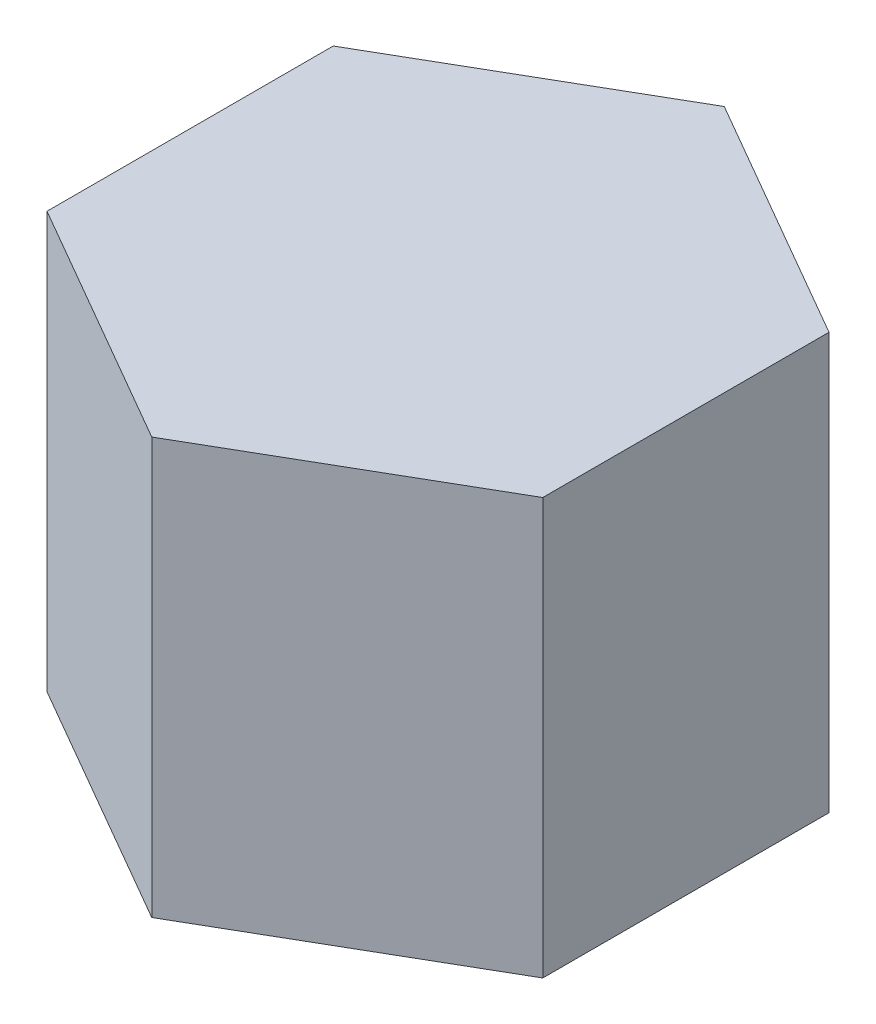
ISO-10303-21;
HEADER;
FILE_DESCRIPTION(('STEP AP214'),'2;1');
FILE_NAME('part.step','',(''),(''),'','','');
FILE_SCHEMA(('AUTOMOTIVE_DESIGN { 1 0 10303 214 1 1 1 1 }'));
ENDSEC;
DATA;
#1=APPLICATION_CONTEXT('core data for automotive mechanical design processes');
#2=APPLICATION_PROTOCOL_DEFINITION('international standard','automotive_design',2000,#1);
#3=PRODUCT_CONTEXT('',#1,'mechanical');
#4=PRODUCT('Part','Part','',(#3));
#5=PRODUCT_RELATED_PRODUCT_CATEGORY('part','',(#4));
#6=PRODUCT_DEFINITION_FORMATION('','',#4);
#7=PRODUCT_DEFINITION_CONTEXT('part definition',#1,'design');
#8=PRODUCT_DEFINITION('design','',#6,#7);
#9=PRODUCT_DEFINITION_SHAPE('','',#8);
#10=(LENGTH_UNIT() NAMED_UNIT(*) SI_UNIT(.MILLI.,.METRE.));
#11=(NAMED_UNIT(*) PLANE_ANGLE_UNIT() SI_UNIT($,.RADIAN.));
#12=(NAMED_UNIT(*) SI_UNIT($,.STERADIAN.) SOLID_ANGLE_UNIT());
#13=UNCERTAINTY_MEASURE_WITH_UNIT(LENGTH_MEASURE(1.E-05),#10,'distance_accuracy_value','');
#14=(GEOMETRIC_REPRESENTATION_CONTEXT(3) GLOBAL_UNCERTAINTY_ASSIGNED_CONTEXT((#13)) GLOBAL_UNIT_ASSIGNED_CONTEXT((#10,
#11,#12)) REPRESENTATION_CONTEXT('',''));
#15=CARTESIAN_POINT('',(0.,0.,0.));
#16=DIRECTION('',(0.,0.,1.));
#17=DIRECTION('',(1.,0.,0.));
#18=AXIS2_PLACEMENT_3D('',#15,#16,#17);
#19=CARTESIAN_POINT('',(204.839551417382,-147.556598747966,294.280047431848));
#20=DIRECTION('',(-0.500000000000096,0.,-0.866025403784383));
#21=DIRECTION('',(-0.866025403784383,0.,0.500000000000096));
#22=AXIS2_PLACEMENT_3D('',#19,#20,#21);
#23=PLANE('',#22);
#24=CARTESIAN_POINT('',(205.142660308706,-147.047793579175,294.105047431848));
#25=DIRECTION('',(-0.866025403784383,0.,0.500000000000096));
#26=VECTOR('',#25,1.);
#27=LINE('',#24,#26);
#28=CARTESIAN_POINT('',(205.142660308706,-147.047793579175,294.105047431848));
#29=VERTEX_POINT('',#28);
#30=CARTESIAN_POINT('',(204.839551417382,-147.047793579175,294.280047431848));
#31=VERTEX_POINT('',#30);
#32=EDGE_CURVE('E170',#29,#31,#27,.T.);
#33=ORIENTED_EDGE('',*,*,#32,.T.);
#34=CARTESIAN_POINT('',(204.839551417382,-147.556598747966,294.280047431848));
#35=DIRECTION('',(0.,1.,0.));
#36=VECTOR('',#35,1.);
#37=LINE('',#34,#36);
#38=CARTESIAN_POINT('',(204.839551417382,-147.556598747966,294.280047431848));
#39=VERTEX_POINT('',#38);
#40=EDGE_CURVE('E35',#39,#31,#37,.T.);
#41=ORIENTED_EDGE('',*,*,#40,.F.);
#42=CARTESIAN_POINT('',(205.142660308706,-147.556598747966,294.105047431848));
#43=DIRECTION('',(-0.866025403784383,0.,0.500000000000096));
#44=VECTOR('',#43,1.);
#45=LINE('',#42,#44);
#46=CARTESIAN_POINT('',(205.142660308706,-147.556598747966,294.105047431848));
#47=VERTEX_POINT('',#46);
#48=EDGE_CURVE('E159',#47,#39,#45,.T.);
#49=ORIENTED_EDGE('',*,*,#48,.F.);
#50=CARTESIAN_POINT('',(205.142660308706,-147.556598747966,294.105047431848));
#51=DIRECTION('',(0.,1.,0.));
#52=VECTOR('',#51,1.);
#53=LINE('',#50,#52);
#54=EDGE_CURVE('E10',#47,#29,#53,.T.);
#55=ORIENTED_EDGE('',*,*,#54,.T.);
#56=EDGE_LOOP('',(#33,#41,#49,#55));
#57=FACE_BOUND('',#56,.T.);
#58=ADVANCED_FACE('F16',(#57),#23,.F.);
#59=CARTESIAN_POINT('',(205.142660308706,-147.556598747966,291.594471220494));
#60=DIRECTION('',(-1.,0.,0.));
#61=DIRECTION('',(0.,-1.,0.));
#62=AXIS2_PLACEMENT_3D('',#59,#60,#61);
#63=PLANE('',#62);
#64=CARTESIAN_POINT('',(205.142660308706,-147.047793579175,293.755047431848));
#65=DIRECTION('',(0.,0.,1.));
#66=VECTOR('',#65,1.);
#67=LINE('',#64,#66);
#68=CARTESIAN_POINT('',(205.142660308706,-147.047793579175,293.755047431848));
#69=VERTEX_POINT('',#68);
#70=EDGE_CURVE('E167',#69,#29,#67,.T.);
#71=ORIENTED_EDGE('',*,*,#70,.T.);
#72=ORIENTED_EDGE('',*,*,#54,.F.);
#73=CARTESIAN_POINT('',(205.142660308706,-147.556598747966,293.755047431848));
#74=DIRECTION('',(0.,0.,1.));
#75=VECTOR('',#74,1.);
#76=LINE('',#73,#75);
#77=CARTESIAN_POINT('',(205.142660308706,-147.556598747966,293.755047431848));
#78=VERTEX_POINT('',#77);
#79=EDGE_CURVE('E156',#78,#47,#76,.T.);
#80=ORIENTED_EDGE('',*,*,#79,.F.);
#81=CARTESIAN_POINT('',(205.142660308706,-147.556598747966,293.755047431848));
#82=DIRECTION('',(0.,1.,0.));
#83=VECTOR('',#82,1.);
#84=LINE('',#81,#83);
#85=EDGE_CURVE('E27',#78,#69,#84,.T.);
#86=ORIENTED_EDGE('',*,*,#85,.T.);
#87=EDGE_LOOP('',(#71,#72,#80,#86));
#88=FACE_BOUND('',#87,.T.);
#89=ADVANCED_FACE('F189',(#88),#63,.F.);
#90=CARTESIAN_POINT('',(205.142660308706,-147.556598747966,293.755047431848));
#91=DIRECTION('',(-0.500000000000096,0.,0.866025403784383));
#92=DIRECTION('',(0.866025403784383,0.,0.500000000000096));
#93=AXIS2_PLACEMENT_3D('',#90,#91,#92);
#94=PLANE('',#93);
#95=CARTESIAN_POINT('',(204.839551417382,-147.047793579175,293.580047431848));
#96=DIRECTION('',(0.866025403784383,0.,0.500000000000096));
#97=VECTOR('',#96,1.);
#98=LINE('',#95,#97);
#99=CARTESIAN_POINT('',(204.839551417382,-147.047793579175,293.580047431848));
#100=VERTEX_POINT('',#99);
#101=EDGE_CURVE('E163',#100,#69,#98,.T.);
#102=ORIENTED_EDGE('',*,*,#101,.T.);
#103=ORIENTED_EDGE('',*,*,#85,.F.);
#104=CARTESIAN_POINT('',(204.839551417382,-147.556598747966,293.580047431848));
#105=DIRECTION('',(0.866025403784383,0.,0.500000000000096));
#106=VECTOR('',#105,1.);
#107=LINE('',#104,#106);
#108=CARTESIAN_POINT('',(204.839551417382,-147.556598747966,293.580047431848));
#109=VERTEX_POINT('',#108);
#110=EDGE_CURVE('E106',#109,#78,#107,.T.);
#111=ORIENTED_EDGE('',*,*,#110,.F.);
#112=CARTESIAN_POINT('',(204.839551417382,-147.556598747966,293.580047431848));
#113=DIRECTION('',(0.,1.,0.));
#114=VECTOR('',#113,1.);
#115=LINE('',#112,#114);
#116=EDGE_CURVE('E94',#109,#100,#115,.T.);
#117=ORIENTED_EDGE('',*,*,#116,.T.);
#118=EDGE_LOOP('',(#102,#103,#111,#117));
#119=FACE_BOUND('',#118,.T.);
#120=ADVANCED_FACE('F198',(#119),#94,.F.);
#121=CARTESIAN_POINT('',(204.839551417382,-147.556598747966,293.580047431848));
#122=DIRECTION('',(0.500000000000096,0.,0.866025403784383));
#123=DIRECTION('',(0.866025403784383,0.,-0.500000000000096));
#124=AXIS2_PLACEMENT_3D('',#121,#122,#123);
#125=PLANE('',#124);
#126=CARTESIAN_POINT('',(204.536442526057,-147.047793579175,293.755047431848));
#127=DIRECTION('',(0.866025403784383,0.,-0.500000000000096));
#128=VECTOR('',#127,1.);
#129=LINE('',#126,#128);
#130=CARTESIAN_POINT('',(204.536442526057,-147.047793579175,293.755047431848));
#131=VERTEX_POINT('',#130);
#132=EDGE_CURVE('E162',#131,#100,#129,.T.);
#133=ORIENTED_EDGE('',*,*,#132,.T.);
#134=ORIENTED_EDGE('',*,*,#116,.F.);
#135=CARTESIAN_POINT('',(204.536442526057,-147.556598747966,293.755047431848));
#136=DIRECTION('',(0.866025403784383,0.,-0.500000000000096));
#137=VECTOR('',#136,1.);
#138=LINE('',#135,#137);
#139=CARTESIAN_POINT('',(204.536442526057,-147.556598747966,293.755047431848));
#140=VERTEX_POINT('',#139);
#141=EDGE_CURVE('E98',#140,#109,#138,.T.);
#142=ORIENTED_EDGE('',*,*,#141,.F.);
#143=CARTESIAN_POINT('',(204.536442526057,-147.556598747966,293.755047431848));
#144=DIRECTION('',(0.,1.,0.));
#145=VECTOR('',#144,1.);
#146=LINE('',#143,#145);
#147=EDGE_CURVE('E79',#140,#131,#146,.T.);
#148=ORIENTED_EDGE('',*,*,#147,.T.);
#149=EDGE_LOOP('',(#133,#134,#142,#148));
#150=FACE_BOUND('',#149,.T.);
#151=ADVANCED_FACE('F100',(#150),#125,.F.);
#152=CARTESIAN_POINT('',(204.536442526057,-147.556598747966,291.594471220494));
#153=DIRECTION('',(1.,0.,0.));
#154=DIRECTION('',(0.,1.,0.));
#155=AXIS2_PLACEMENT_3D('',#152,#153,#154);
#156=PLANE('',#155);
#157=CARTESIAN_POINT('',(204.536442526057,-147.047793579175,294.105047431848));
#158=DIRECTION('',(0.,0.,-1.));
#159=VECTOR('',#158,1.);
#160=LINE('',#157,#159);
#161=CARTESIAN_POINT('',(204.536442526057,-147.047793579175,294.105047431848));
#162=VERTEX_POINT('',#161);
#163=EDGE_CURVE('E88',#162,#131,#160,.T.);
#164=ORIENTED_EDGE('',*,*,#163,.T.);
#165=ORIENTED_EDGE('',*,*,#147,.F.);
#166=CARTESIAN_POINT('',(204.536442526057,-147.556598747966,294.105047431848));
#167=DIRECTION('',(0.,0.,-1.));
#168=VECTOR('',#167,1.);
#169=LINE('',#166,#168);
#170=CARTESIAN_POINT('',(204.536442526057,-147.556598747966,294.105047431848));
#171=VERTEX_POINT('',#170);
#172=EDGE_CURVE('E84',#171,#140,#169,.T.);
#173=ORIENTED_EDGE('',*,*,#172,.F.);
#174=CARTESIAN_POINT('',(204.536442526057,-147.556598747966,294.105047431848));
#175=DIRECTION('',(0.,1.,0.));
#176=VECTOR('',#175,1.);
#177=LINE('',#174,#176);
#178=EDGE_CURVE('E58',#171,#162,#177,.T.);
#179=ORIENTED_EDGE('',*,*,#178,.T.);
#180=EDGE_LOOP('',(#164,#165,#173,#179));
#181=FACE_BOUND('',#180,.T.);
#182=ADVANCED_FACE('F82',(#181),#156,.F.);
#183=CARTESIAN_POINT('',(204.536442526057,-147.556598747966,294.105047431848));
#184=DIRECTION('',(0.500000000000062,0.,-0.866025403784403));
#185=DIRECTION('',(-0.866025403784403,0.,-0.500000000000062));
#186=AXIS2_PLACEMENT_3D('',#183,#184,#185);
#187=PLANE('',#186);
#188=CARTESIAN_POINT('',(204.839551417382,-147.047793579175,294.280047431848));
#189=DIRECTION('',(-0.866025403784403,0.,-0.500000000000062));
#190=VECTOR('',#189,1.);
#191=LINE('',#188,#190);
#192=EDGE_CURVE('E160',#31,#162,#191,.T.);
#193=ORIENTED_EDGE('',*,*,#192,.T.);
#194=ORIENTED_EDGE('',*,*,#178,.F.);
#195=CARTESIAN_POINT('',(204.839551417382,-147.556598747966,294.280047431848));
#196=DIRECTION('',(-0.866025403784403,0.,-0.500000000000062));
#197=VECTOR('',#196,1.);
#198=LINE('',#195,#197);
#199=EDGE_CURVE('E112',#39,#171,#198,.T.);
#200=ORIENTED_EDGE('',*,*,#199,.F.);
#201=ORIENTED_EDGE('',*,*,#40,.T.);
#202=EDGE_LOOP('',(#193,#194,#200,#201));
#203=FACE_BOUND('',#202,.T.);
#204=ADVANCED_FACE('F131',(#203),#187,.F.);
#205=CARTESIAN_POINT('',(206.491105863044,-147.556598747966,291.594471220494));
#206=DIRECTION('',(0.,1.,0.));
#207=DIRECTION('',(-1.,0.,0.));
#208=AXIS2_PLACEMENT_3D('',#205,#206,#207);
#209=PLANE('',#208);
#210=ORIENTED_EDGE('',*,*,#48,.T.);
#211=ORIENTED_EDGE('',*,*,#199,.T.);
#212=ORIENTED_EDGE('',*,*,#172,.T.);
#213=ORIENTED_EDGE('',*,*,#141,.T.);
#214=ORIENTED_EDGE('',*,*,#110,.T.);
#215=ORIENTED_EDGE('',*,*,#79,.T.);
#216=EDGE_LOOP('',(#210,#211,#212,#213,#214,#215));
#217=FACE_BOUND('',#216,.T.);
#218=ADVANCED_FACE('F111',(#217),#209,.F.);
#219=CARTESIAN_POINT('',(206.491105863044,-147.047793579175,291.594471220494));
#220=DIRECTION('',(0.,1.,0.));
#221=DIRECTION('',(-1.,0.,0.));
#222=AXIS2_PLACEMENT_3D('',#219,#220,#221);
#223=PLANE('',#222);
#224=ORIENTED_EDGE('',*,*,#32,.F.);
#225=ORIENTED_EDGE('',*,*,#70,.F.);
#226=ORIENTED_EDGE('',*,*,#101,.F.);
#227=ORIENTED_EDGE('',*,*,#132,.F.);
#228=ORIENTED_EDGE('',*,*,#163,.F.);
#229=ORIENTED_EDGE('',*,*,#192,.F.);
#230=EDGE_LOOP('',(#224,#225,#226,#227,#228,#229));
#231=FACE_BOUND('',#230,.T.);
#232=ADVANCED_FACE('F130',(#231),#223,.T.);
#233=CLOSED_SHELL('',(#58,#89,#120,#151,#182,#204,#218,#232));
#234=MANIFOLD_SOLID_BREP('B1',#233);
#235=ADVANCED_BREP_SHAPE_REPRESENTATION('',(#18,#234),#14);
#236=SHAPE_DEFINITION_REPRESENTATION(#9,#235);
ENDSEC;
END-ISO-10303-21;
